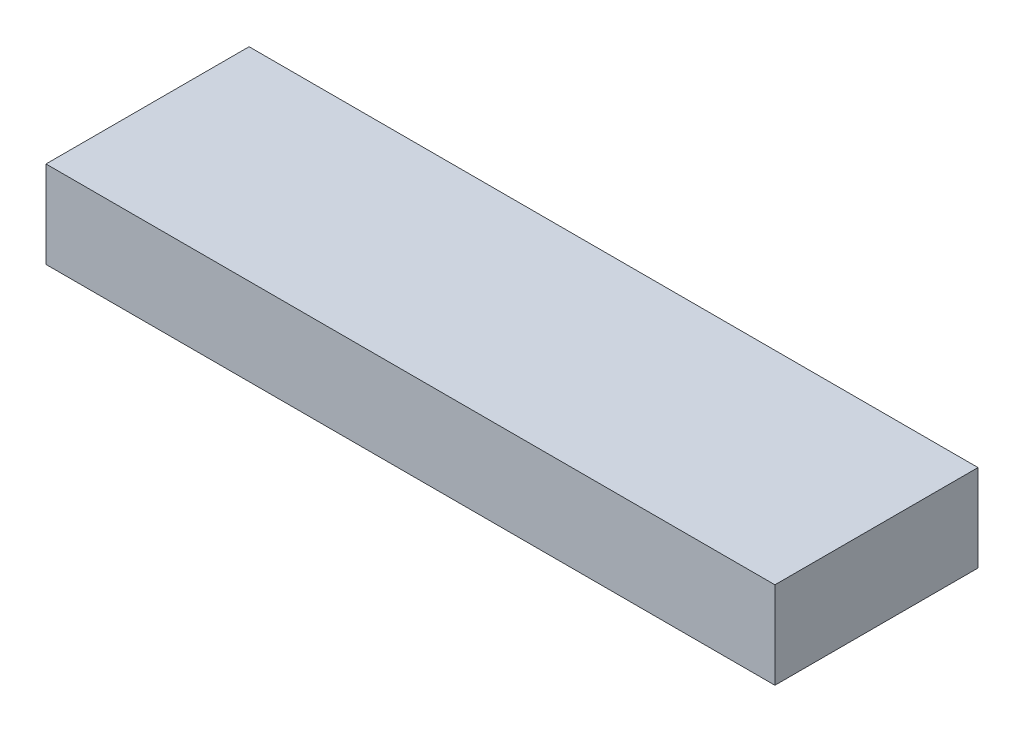
ISO-10303-21;
HEADER;
FILE_DESCRIPTION(('STEP AP214'),'2;1');
FILE_NAME('part.step','',(''),(''),'','','');
FILE_SCHEMA(('AUTOMOTIVE_DESIGN { 1 0 10303 214 1 1 1 1 }'));
ENDSEC;
DATA;
#1=APPLICATION_CONTEXT('core data for automotive mechanical design processes');
#2=APPLICATION_PROTOCOL_DEFINITION('international standard','automotive_design',2000,#1);
#3=PRODUCT_CONTEXT('',#1,'mechanical');
#4=PRODUCT('Part','Part','',(#3));
#5=PRODUCT_RELATED_PRODUCT_CATEGORY('part','',(#4));
#6=PRODUCT_DEFINITION_FORMATION('','',#4);
#7=PRODUCT_DEFINITION_CONTEXT('part definition',#1,'design');
#8=PRODUCT_DEFINITION('design','',#6,#7);
#9=PRODUCT_DEFINITION_SHAPE('','',#8);
#10=(LENGTH_UNIT() NAMED_UNIT(*) SI_UNIT(.MILLI.,.METRE.));
#11=(NAMED_UNIT(*) PLANE_ANGLE_UNIT() SI_UNIT($,.RADIAN.));
#12=(NAMED_UNIT(*) SI_UNIT($,.STERADIAN.) SOLID_ANGLE_UNIT());
#13=UNCERTAINTY_MEASURE_WITH_UNIT(LENGTH_MEASURE(1.E-05),#10,'distance_accuracy_value','');
#14=(GEOMETRIC_REPRESENTATION_CONTEXT(3) GLOBAL_UNCERTAINTY_ASSIGNED_CONTEXT((#13)) GLOBAL_UNIT_ASSIGNED_CONTEXT((#10,
#11,#12)) REPRESENTATION_CONTEXT('',''));
#15=CARTESIAN_POINT('',(0.,0.,0.));
#16=DIRECTION('',(0.,0.,1.));
#17=DIRECTION('',(1.,0.,0.));
#18=AXIS2_PLACEMENT_3D('',#15,#16,#17);
#19=CARTESIAN_POINT('',(0.,38.1,0.));
#20=DIRECTION('',(1.,0.,0.));
#21=DIRECTION('',(0.,0.,-1.));
#22=AXIS2_PLACEMENT_3D('',#19,#20,#21);
#23=PLANE('',#22);
#24=DIRECTION('',(0.,0.,1.));
#25=VECTOR('',#24,1.);
#26=CARTESIAN_POINT('',(0.,0.,0.));
#27=LINE('',#26,#25);
#28=CARTESIAN_POINT('',(0.,0.,-88.9));
#29=VERTEX_POINT('',#28);
#30=CARTESIAN_POINT('',(0.,0.,0.));
#31=VERTEX_POINT('',#30);
#32=EDGE_CURVE('E101',#29,#31,#27,.T.);
#33=ORIENTED_EDGE('',*,*,#32,.T.);
#34=DIRECTION('',(0.,-1.,0.));
#35=VECTOR('',#34,1.);
#36=CARTESIAN_POINT('',(0.,38.1,0.));
#37=LINE('',#36,#35);
#38=CARTESIAN_POINT('',(0.,38.1,0.));
#39=VERTEX_POINT('',#38);
#40=EDGE_CURVE('E11',#39,#31,#37,.T.);
#41=ORIENTED_EDGE('',*,*,#40,.F.);
#42=DIRECTION('',(0.,0.,1.));
#43=VECTOR('',#42,1.);
#44=CARTESIAN_POINT('',(0.,38.1,0.));
#45=LINE('',#44,#43);
#46=CARTESIAN_POINT('',(0.,38.1,-88.9));
#47=VERTEX_POINT('',#46);
#48=EDGE_CURVE('E89',#47,#39,#45,.T.);
#49=ORIENTED_EDGE('',*,*,#48,.F.);
#50=DIRECTION('',(0.,-1.,0.));
#51=VECTOR('',#50,1.);
#52=CARTESIAN_POINT('',(0.,38.1,-88.9));
#53=LINE('',#52,#51);
#54=EDGE_CURVE('E97',#47,#29,#53,.T.);
#55=ORIENTED_EDGE('',*,*,#54,.T.);
#56=EDGE_LOOP('',(#33,#41,#49,#55));
#57=FACE_BOUND('',#56,.T.);
#58=ADVANCED_FACE('F38',(#57),#23,.F.);
#59=CARTESIAN_POINT('',(0.,38.1,0.));
#60=DIRECTION('',(0.,0.,-1.));
#61=DIRECTION('',(-1.,0.,0.));
#62=AXIS2_PLACEMENT_3D('',#59,#60,#61);
#63=PLANE('',#62);
#64=DIRECTION('',(1.,0.,0.));
#65=VECTOR('',#64,1.);
#66=CARTESIAN_POINT('',(0.,0.,0.));
#67=LINE('',#66,#65);
#68=CARTESIAN_POINT('',(319.0875,0.,0.));
#69=VERTEX_POINT('',#68);
#70=EDGE_CURVE('E93',#31,#69,#67,.T.);
#71=ORIENTED_EDGE('',*,*,#70,.T.);
#72=DIRECTION('',(0.,-1.,0.));
#73=VECTOR('',#72,1.);
#74=CARTESIAN_POINT('',(319.0875,38.1,0.));
#75=LINE('',#74,#73);
#76=CARTESIAN_POINT('',(319.0875,38.1,0.));
#77=VERTEX_POINT('',#76);
#78=EDGE_CURVE('E46',#77,#69,#75,.T.);
#79=ORIENTED_EDGE('',*,*,#78,.F.);
#80=DIRECTION('',(1.,0.,0.));
#81=VECTOR('',#80,1.);
#82=CARTESIAN_POINT('',(0.,38.1,0.));
#83=LINE('',#82,#81);
#84=EDGE_CURVE('E84',#39,#77,#83,.T.);
#85=ORIENTED_EDGE('',*,*,#84,.F.);
#86=ORIENTED_EDGE('',*,*,#40,.T.);
#87=EDGE_LOOP('',(#71,#79,#85,#86));
#88=FACE_BOUND('',#87,.T.);
#89=ADVANCED_FACE('F92',(#88),#63,.F.);
#90=CARTESIAN_POINT('',(319.0875,38.1,0.));
#91=DIRECTION('',(-1.,0.,0.));
#92=DIRECTION('',(0.,0.,1.));
#93=AXIS2_PLACEMENT_3D('',#90,#91,#92);
#94=PLANE('',#93);
#95=DIRECTION('',(0.,0.,-1.));
#96=VECTOR('',#95,1.);
#97=CARTESIAN_POINT('',(319.0875,0.,0.));
#98=LINE('',#97,#96);
#99=CARTESIAN_POINT('',(319.0875,0.,-88.9));
#100=VERTEX_POINT('',#99);
#101=EDGE_CURVE('E71',#69,#100,#98,.T.);
#102=ORIENTED_EDGE('',*,*,#101,.T.);
#103=DIRECTION('',(0.,-1.,0.));
#104=VECTOR('',#103,1.);
#105=CARTESIAN_POINT('',(319.0875,38.1,-88.9));
#106=LINE('',#105,#104);
#107=CARTESIAN_POINT('',(319.0875,38.1,-88.9));
#108=VERTEX_POINT('',#107);
#109=EDGE_CURVE('E94',#108,#100,#106,.T.);
#110=ORIENTED_EDGE('',*,*,#109,.F.);
#111=DIRECTION('',(0.,0.,-1.));
#112=VECTOR('',#111,1.);
#113=CARTESIAN_POINT('',(319.0875,38.1,0.));
#114=LINE('',#113,#112);
#115=EDGE_CURVE('E87',#77,#108,#114,.T.);
#116=ORIENTED_EDGE('',*,*,#115,.F.);
#117=ORIENTED_EDGE('',*,*,#78,.T.);
#118=EDGE_LOOP('',(#102,#110,#116,#117));
#119=FACE_BOUND('',#118,.T.);
#120=ADVANCED_FACE('F95',(#119),#94,.F.);
#121=CARTESIAN_POINT('',(0.,38.1,-88.9));
#122=DIRECTION('',(0.,0.,1.));
#123=DIRECTION('',(1.,0.,0.));
#124=AXIS2_PLACEMENT_3D('',#121,#122,#123);
#125=PLANE('',#124);
#126=DIRECTION('',(-1.,0.,0.));
#127=VECTOR('',#126,1.);
#128=CARTESIAN_POINT('',(0.,0.,-88.9));
#129=LINE('',#128,#127);
#130=EDGE_CURVE('E77',#100,#29,#129,.T.);
#131=ORIENTED_EDGE('',*,*,#130,.T.);
#132=ORIENTED_EDGE('',*,*,#54,.F.);
#133=DIRECTION('',(-1.,0.,0.));
#134=VECTOR('',#133,1.);
#135=CARTESIAN_POINT('',(0.,38.1,-88.9));
#136=LINE('',#135,#134);
#137=EDGE_CURVE('E54',#108,#47,#136,.T.);
#138=ORIENTED_EDGE('',*,*,#137,.F.);
#139=ORIENTED_EDGE('',*,*,#109,.T.);
#140=EDGE_LOOP('',(#131,#132,#138,#139));
#141=FACE_BOUND('',#140,.T.);
#142=ADVANCED_FACE('F108',(#141),#125,.F.);
#143=CARTESIAN_POINT('',(0.,38.1,0.));
#144=DIRECTION('',(0.,-1.,0.));
#145=DIRECTION('',(0.,0.,-1.));
#146=AXIS2_PLACEMENT_3D('',#143,#144,#145);
#147=PLANE('',#146);
#148=ORIENTED_EDGE('',*,*,#48,.T.);
#149=ORIENTED_EDGE('',*,*,#84,.T.);
#150=ORIENTED_EDGE('',*,*,#115,.T.);
#151=ORIENTED_EDGE('',*,*,#137,.T.);
#152=EDGE_LOOP('',(#148,#149,#150,#151));
#153=FACE_BOUND('',#152,.T.);
#154=ADVANCED_FACE('F85',(#153),#147,.F.);
#155=CARTESIAN_POINT('',(0.,0.,0.));
#156=DIRECTION('',(0.,-1.,0.));
#157=DIRECTION('',(0.,0.,-1.));
#158=AXIS2_PLACEMENT_3D('',#155,#156,#157);
#159=PLANE('',#158);
#160=ORIENTED_EDGE('',*,*,#32,.F.);
#161=ORIENTED_EDGE('',*,*,#130,.F.);
#162=ORIENTED_EDGE('',*,*,#101,.F.);
#163=ORIENTED_EDGE('',*,*,#70,.F.);
#164=EDGE_LOOP('',(#160,#161,#162,#163));
#165=FACE_BOUND('',#164,.T.);
#166=ADVANCED_FACE('F111',(#165),#159,.T.);
#167=CLOSED_SHELL('',(#58,#89,#120,#142,#154,#166));
#168=MANIFOLD_SOLID_BREP('B2',#167);
#169=ADVANCED_BREP_SHAPE_REPRESENTATION('',(#18,#168),#14);
#170=SHAPE_DEFINITION_REPRESENTATION(#9,#169);
ENDSEC;
END-ISO-10303-21;
